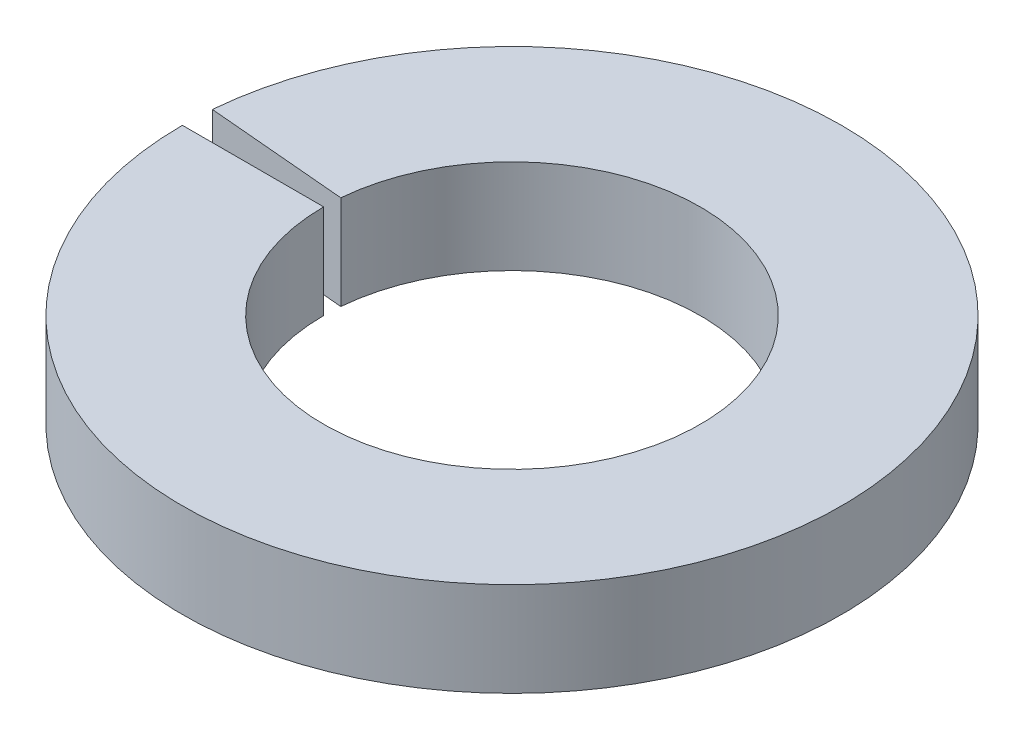
ISO-10303-21;
HEADER;
FILE_DESCRIPTION(('STEP AP214'),'2;1');
FILE_NAME('part.step','',(''),(''),'','','');
FILE_SCHEMA(('AUTOMOTIVE_DESIGN { 1 0 10303 214 1 1 1 1 }'));
ENDSEC;
DATA;
#1=APPLICATION_CONTEXT('core data for automotive mechanical design processes');
#2=APPLICATION_PROTOCOL_DEFINITION('international standard','automotive_design',2000,#1);
#3=PRODUCT_CONTEXT('',#1,'mechanical');
#4=PRODUCT('Part','Part','',(#3));
#5=PRODUCT_RELATED_PRODUCT_CATEGORY('part','',(#4));
#6=PRODUCT_DEFINITION_FORMATION('','',#4);
#7=PRODUCT_DEFINITION_CONTEXT('part definition',#1,'design');
#8=PRODUCT_DEFINITION('design','',#6,#7);
#9=PRODUCT_DEFINITION_SHAPE('','',#8);
#10=(LENGTH_UNIT() NAMED_UNIT(*) SI_UNIT(.MILLI.,.METRE.));
#11=(NAMED_UNIT(*) PLANE_ANGLE_UNIT() SI_UNIT($,.RADIAN.));
#12=(NAMED_UNIT(*) SI_UNIT($,.STERADIAN.) SOLID_ANGLE_UNIT());
#13=UNCERTAINTY_MEASURE_WITH_UNIT(LENGTH_MEASURE(1.E-05),#10,'distance_accuracy_value','');
#14=(GEOMETRIC_REPRESENTATION_CONTEXT(3) GLOBAL_UNCERTAINTY_ASSIGNED_CONTEXT((#13)) GLOBAL_UNIT_ASSIGNED_CONTEXT((#10,
#11,#12)) REPRESENTATION_CONTEXT('',''));
#15=CARTESIAN_POINT('',(0.,0.,0.));
#16=DIRECTION('',(0.,0.,1.));
#17=DIRECTION('',(1.,0.,0.));
#18=AXIS2_PLACEMENT_3D('',#15,#16,#17);
#19=CARTESIAN_POINT('',(0.,0.,0.));
#20=DIRECTION('',(0.,-1.,0.));
#21=DIRECTION('',(0.,0.,-1.));
#22=AXIS2_PLACEMENT_3D('',#19,#20,#21);
#23=CYLINDRICAL_SURFACE('',#22,11.1125);
#24=CARTESIAN_POINT('',(0.,3.175,0.));
#25=DIRECTION('',(0.,-1.,0.));
#26=DIRECTION('',(0.,0.,-1.));
#27=AXIS2_PLACEMENT_3D('',#24,#25,#26);
#28=CIRCLE('',#27,11.1125);
#29=CARTESIAN_POINT('',(-11.0702135825445,3.175,-0.968518191283206));
#30=VERTEX_POINT('',#29);
#31=CARTESIAN_POINT('',(-11.1125,3.175,0.));
#32=VERTEX_POINT('',#31);
#33=EDGE_CURVE('E11',#30,#32,#28,.T.);
#34=ORIENTED_EDGE('',*,*,#33,.T.);
#35=DIRECTION('',(0.,-1.,0.));
#36=VECTOR('',#35,1.);
#37=CARTESIAN_POINT('',(-11.1125,0.,0.));
#38=LINE('',#37,#36);
#39=CARTESIAN_POINT('',(-11.1125,0.,0.));
#40=VERTEX_POINT('',#39);
#41=EDGE_CURVE('E95',#32,#40,#38,.T.);
#42=ORIENTED_EDGE('',*,*,#41,.T.);
#43=CARTESIAN_POINT('',(0.,0.,0.));
#44=DIRECTION('',(0.,-1.,0.));
#45=DIRECTION('',(0.,0.,-1.));
#46=AXIS2_PLACEMENT_3D('',#43,#44,#45);
#47=CIRCLE('',#46,11.1125);
#48=CARTESIAN_POINT('',(-11.0702135825445,0.,-0.968518191283206));
#49=VERTEX_POINT('',#48);
#50=EDGE_CURVE('E77',#49,#40,#47,.T.);
#51=ORIENTED_EDGE('',*,*,#50,.F.);
#52=DIRECTION('',(0.,-1.,0.));
#53=VECTOR('',#52,1.);
#54=CARTESIAN_POINT('',(-11.0702135825445,0.,-0.968518191283206));
#55=LINE('',#54,#53);
#56=EDGE_CURVE('E103',#30,#49,#55,.T.);
#57=ORIENTED_EDGE('',*,*,#56,.F.);
#58=EDGE_LOOP('',(#34,#42,#51,#57));
#59=FACE_BOUND('',#58,.T.);
#60=ADVANCED_FACE('F37',(#59),#23,.T.);
#61=CARTESIAN_POINT('',(-11.0702135825445,3.175,-0.968518191283206));
#62=DIRECTION('',(0.,-1.,0.));
#63=DIRECTION('',(0.,0.,-1.));
#64=AXIS2_PLACEMENT_3D('',#61,#62,#63);
#65=PLANE('',#64);
#66=CARTESIAN_POINT('',(0.,3.175,0.));
#67=DIRECTION('',(0.,-1.,0.));
#68=DIRECTION('',(0.,0.,-1.));
#69=AXIS2_PLACEMENT_3D('',#66,#67,#68);
#70=CIRCLE('',#69,6.35);
#71=CARTESIAN_POINT('',(-6.32583633288259,3.175,-0.553438966447546));
#72=VERTEX_POINT('',#71);
#73=CARTESIAN_POINT('',(-6.35,3.175,0.));
#74=VERTEX_POINT('',#73);
#75=EDGE_CURVE('E45',#72,#74,#70,.T.);
#76=ORIENTED_EDGE('',*,*,#75,.T.);
#77=DIRECTION('',(-1.,0.,0.));
#78=VECTOR('',#77,1.);
#79=CARTESIAN_POINT('',(-11.1125,3.175,0.));
#80=LINE('',#79,#78);
#81=EDGE_CURVE('E101',#74,#32,#80,.T.);
#82=ORIENTED_EDGE('',*,*,#81,.T.);
#83=ORIENTED_EDGE('',*,*,#33,.F.);
#84=DIRECTION('',(-0.996194698091747,0.,-0.087155742747645));
#85=VECTOR('',#84,1.);
#86=CARTESIAN_POINT('',(-11.0702135825445,3.175,-0.968518191283206));
#87=LINE('',#86,#85);
#88=EDGE_CURVE('E89',#72,#30,#87,.T.);
#89=ORIENTED_EDGE('',*,*,#88,.F.);
#90=EDGE_LOOP('',(#76,#82,#83,#89));
#91=FACE_BOUND('',#90,.T.);
#92=ADVANCED_FACE('F39',(#91),#65,.F.);
#93=CARTESIAN_POINT('',(0.,0.,0.));
#94=DIRECTION('',(0.,-1.,0.));
#95=DIRECTION('',(0.,0.,-1.));
#96=AXIS2_PLACEMENT_3D('',#93,#94,#95);
#97=CYLINDRICAL_SURFACE('',#96,6.35);
#98=CARTESIAN_POINT('',(0.,0.,0.));
#99=DIRECTION('',(0.,-1.,0.));
#100=DIRECTION('',(0.,0.,-1.));
#101=AXIS2_PLACEMENT_3D('',#98,#99,#100);
#102=CIRCLE('',#101,6.35);
#103=CARTESIAN_POINT('',(-6.32583633288259,0.,-0.553438966447546));
#104=VERTEX_POINT('',#103);
#105=CARTESIAN_POINT('',(-6.35,0.,0.));
#106=VERTEX_POINT('',#105);
#107=EDGE_CURVE('E88',#104,#106,#102,.T.);
#108=ORIENTED_EDGE('',*,*,#107,.T.);
#109=DIRECTION('',(0.,1.,0.));
#110=VECTOR('',#109,1.);
#111=CARTESIAN_POINT('',(-6.35,0.,0.));
#112=LINE('',#111,#110);
#113=EDGE_CURVE('E96',#106,#74,#112,.T.);
#114=ORIENTED_EDGE('',*,*,#113,.T.);
#115=ORIENTED_EDGE('',*,*,#75,.F.);
#116=DIRECTION('',(0.,1.,0.));
#117=VECTOR('',#116,1.);
#118=CARTESIAN_POINT('',(-6.32583633288259,0.,-0.553438966447546));
#119=LINE('',#118,#117);
#120=EDGE_CURVE('E106',#104,#72,#119,.T.);
#121=ORIENTED_EDGE('',*,*,#120,.F.);
#122=EDGE_LOOP('',(#108,#114,#115,#121));
#123=FACE_BOUND('',#122,.T.);
#124=ADVANCED_FACE('F109',(#123),#97,.F.);
#125=CARTESIAN_POINT('',(-11.0702135825445,0.,-0.968518191283206));
#126=DIRECTION('',(0.,1.,0.));
#127=DIRECTION('',(0.,0.,1.));
#128=AXIS2_PLACEMENT_3D('',#125,#126,#127);
#129=PLANE('',#128);
#130=DIRECTION('',(0.996194698091747,0.,0.087155742747645));
#131=VECTOR('',#130,1.);
#132=CARTESIAN_POINT('',(-11.0702135825445,0.,-0.968518191283206));
#133=LINE('',#132,#131);
#134=EDGE_CURVE('E83',#49,#104,#133,.T.);
#135=ORIENTED_EDGE('',*,*,#134,.F.);
#136=ORIENTED_EDGE('',*,*,#50,.T.);
#137=DIRECTION('',(1.,0.,0.));
#138=VECTOR('',#137,1.);
#139=CARTESIAN_POINT('',(-11.1125,0.,0.));
#140=LINE('',#139,#138);
#141=EDGE_CURVE('E80',#40,#106,#140,.T.);
#142=ORIENTED_EDGE('',*,*,#141,.T.);
#143=ORIENTED_EDGE('',*,*,#107,.F.);
#144=EDGE_LOOP('',(#135,#136,#142,#143));
#145=FACE_BOUND('',#144,.T.);
#146=ADVANCED_FACE('F79',(#145),#129,.F.);
#147=CARTESIAN_POINT('',(0.,0.,0.));
#148=DIRECTION('',(0.087155742747645,0.,-0.996194698091747));
#149=DIRECTION('',(-0.996194698091747,0.,-0.087155742747645));
#150=AXIS2_PLACEMENT_3D('',#147,#148,#149);
#151=PLANE('',#150);
#152=ORIENTED_EDGE('',*,*,#56,.T.);
#153=ORIENTED_EDGE('',*,*,#134,.T.);
#154=ORIENTED_EDGE('',*,*,#120,.T.);
#155=ORIENTED_EDGE('',*,*,#88,.T.);
#156=EDGE_LOOP('',(#152,#153,#154,#155));
#157=FACE_BOUND('',#156,.T.);
#158=ADVANCED_FACE('F111',(#157),#151,.F.);
#159=CARTESIAN_POINT('',(0.,0.,0.));
#160=DIRECTION('',(0.,0.,-1.));
#161=DIRECTION('',(-1.,0.,0.));
#162=AXIS2_PLACEMENT_3D('',#159,#160,#161);
#163=PLANE('',#162);
#164=ORIENTED_EDGE('',*,*,#41,.F.);
#165=ORIENTED_EDGE('',*,*,#81,.F.);
#166=ORIENTED_EDGE('',*,*,#113,.F.);
#167=ORIENTED_EDGE('',*,*,#141,.F.);
#168=EDGE_LOOP('',(#164,#165,#166,#167));
#169=FACE_BOUND('',#168,.T.);
#170=ADVANCED_FACE('F93',(#169),#163,.T.);
#171=CLOSED_SHELL('',(#60,#92,#124,#146,#158,#170));
#172=MANIFOLD_SOLID_BREP('B2',#171);
#173=ADVANCED_BREP_SHAPE_REPRESENTATION('',(#18,#172),#14);
#174=SHAPE_DEFINITION_REPRESENTATION(#9,#173);
ENDSEC;
END-ISO-10303-21;
